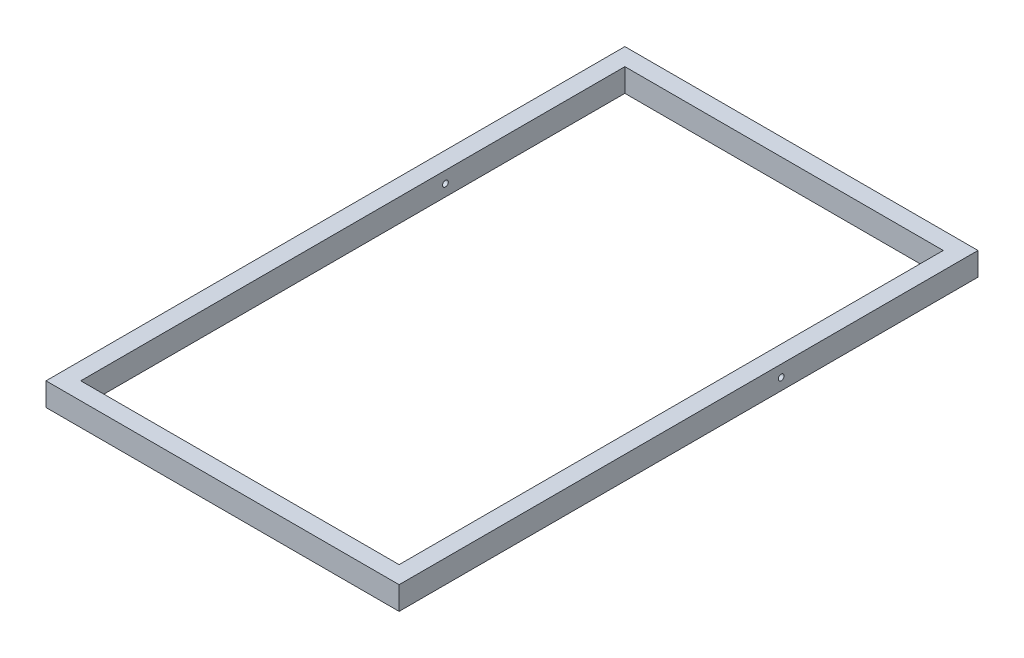
ISO-10303-21;
HEADER;
FILE_DESCRIPTION(('STEP AP214'),'2;1');
FILE_NAME('part.step','',(''),(''),'','','');
FILE_SCHEMA(('AUTOMOTIVE_DESIGN { 1 0 10303 214 1 1 1 1 }'));
ENDSEC;
DATA;
#1=APPLICATION_CONTEXT('core data for automotive mechanical design processes');
#2=APPLICATION_PROTOCOL_DEFINITION('international standard','automotive_design',2000,#1);
#3=PRODUCT_CONTEXT('',#1,'mechanical');
#4=PRODUCT('Part','Part','',(#3));
#5=PRODUCT_RELATED_PRODUCT_CATEGORY('part','',(#4));
#6=PRODUCT_DEFINITION_FORMATION('','',#4);
#7=PRODUCT_DEFINITION_CONTEXT('part definition',#1,'design');
#8=PRODUCT_DEFINITION('design','',#6,#7);
#9=PRODUCT_DEFINITION_SHAPE('','',#8);
#10=(LENGTH_UNIT() NAMED_UNIT(*) SI_UNIT(.MILLI.,.METRE.));
#11=(NAMED_UNIT(*) PLANE_ANGLE_UNIT() SI_UNIT($,.RADIAN.));
#12=(NAMED_UNIT(*) SI_UNIT($,.STERADIAN.) SOLID_ANGLE_UNIT());
#13=UNCERTAINTY_MEASURE_WITH_UNIT(LENGTH_MEASURE(1.E-05),#10,'distance_accuracy_value','');
#14=(GEOMETRIC_REPRESENTATION_CONTEXT(3) GLOBAL_UNCERTAINTY_ASSIGNED_CONTEXT((#13)) GLOBAL_UNIT_ASSIGNED_CONTEXT((#10,
#11,#12)) REPRESENTATION_CONTEXT('',''));
#15=CARTESIAN_POINT('',(0.,0.,0.));
#16=DIRECTION('',(0.,0.,1.));
#17=DIRECTION('',(1.,0.,0.));
#18=AXIS2_PLACEMENT_3D('',#15,#16,#17);
#19=CARTESIAN_POINT('',(0.,40.,0.));
#20=DIRECTION('',(0.,1.,0.));
#21=DIRECTION('',(0.,0.,1.));
#22=AXIS2_PLACEMENT_3D('',#19,#20,#21);
#23=PLANE('',#22);
#24=DIRECTION('',(-1.,0.,0.));
#25=VECTOR('',#24,1.);
#26=CARTESIAN_POINT('',(542.03426406642,40.,-973.725626832782));
#27=LINE('',#26,#25);
#28=CARTESIAN_POINT('',(542.03426406642,40.,-973.725626832782));
#29=VERTEX_POINT('',#28);
#30=CARTESIAN_POINT('',(-67.9657359335805,40.,-973.725626832782));
#31=VERTEX_POINT('',#30);
#32=EDGE_CURVE('E137',#29,#31,#27,.T.);
#33=ORIENTED_EDGE('',*,*,#32,.T.);
#34=DIRECTION('',(0.,0.,1.));
#35=VECTOR('',#34,1.);
#36=CARTESIAN_POINT('',(-67.9657359335805,40.,-973.725626832782));
#37=LINE('',#36,#35);
#38=CARTESIAN_POINT('',(-67.9657359335804,40.,26.2743731672174));
#39=VERTEX_POINT('',#38);
#40=EDGE_CURVE('E140',#31,#39,#37,.T.);
#41=ORIENTED_EDGE('',*,*,#40,.T.);
#42=DIRECTION('',(1.,0.,0.));
#43=VECTOR('',#42,1.);
#44=CARTESIAN_POINT('',(-67.9657359335804,40.,26.2743731672174));
#45=LINE('',#44,#43);
#46=CARTESIAN_POINT('',(542.03426406642,40.,26.2743731672174));
#47=VERTEX_POINT('',#46);
#48=EDGE_CURVE('E143',#39,#47,#45,.T.);
#49=ORIENTED_EDGE('',*,*,#48,.T.);
#50=DIRECTION('',(0.,0.,-1.));
#51=VECTOR('',#50,1.);
#52=CARTESIAN_POINT('',(542.03426406642,40.,26.2743731672174));
#53=LINE('',#52,#51);
#54=EDGE_CURVE('E145',#47,#29,#53,.T.);
#55=ORIENTED_EDGE('',*,*,#54,.T.);
#56=EDGE_LOOP('',(#33,#41,#49,#55));
#57=FACE_BOUND('',#56,.T.);
#58=DIRECTION('',(0.,0.,1.));
#59=VECTOR('',#58,1.);
#60=CARTESIAN_POINT('',(-37.9657359335805,40.,-943.725626832782));
#61=LINE('',#60,#59);
#62=CARTESIAN_POINT('',(-37.9657359335805,40.,-943.725626832782));
#63=VERTEX_POINT('',#62);
#64=CARTESIAN_POINT('',(-37.9657359335804,40.,-3.72562683278258));
#65=VERTEX_POINT('',#64);
#66=EDGE_CURVE('E107',#63,#65,#61,.T.);
#67=ORIENTED_EDGE('',*,*,#66,.F.);
#68=DIRECTION('',(-1.,0.,0.));
#69=VECTOR('',#68,1.);
#70=CARTESIAN_POINT('',(512.03426406642,40.,-943.725626832782));
#71=LINE('',#70,#69);
#72=CARTESIAN_POINT('',(512.03426406642,40.,-943.725626832782));
#73=VERTEX_POINT('',#72);
#74=EDGE_CURVE('E99',#73,#63,#71,.T.);
#75=ORIENTED_EDGE('',*,*,#74,.F.);
#76=DIRECTION('',(0.,0.,-1.));
#77=VECTOR('',#76,1.);
#78=CARTESIAN_POINT('',(512.03426406642,40.,-3.72562683278258));
#79=LINE('',#78,#77);
#80=CARTESIAN_POINT('',(512.03426406642,40.,-3.72562683278258));
#81=VERTEX_POINT('',#80);
#82=EDGE_CURVE('E121',#81,#73,#79,.T.);
#83=ORIENTED_EDGE('',*,*,#82,.F.);
#84=DIRECTION('',(1.,0.,0.));
#85=VECTOR('',#84,1.);
#86=CARTESIAN_POINT('',(-37.9657359335804,40.,-3.72562683278258));
#87=LINE('',#86,#85);
#88=EDGE_CURVE('E119',#65,#81,#87,.T.);
#89=ORIENTED_EDGE('',*,*,#88,.F.);
#90=EDGE_LOOP('',(#67,#75,#83,#89));
#91=FACE_BOUND('',#90,.T.);
#92=ADVANCED_FACE('F33',(#57,#91),#23,.T.);
#93=CARTESIAN_POINT('',(0.,0.,0.));
#94=DIRECTION('',(0.,1.,0.));
#95=DIRECTION('',(0.,0.,1.));
#96=AXIS2_PLACEMENT_3D('',#93,#94,#95);
#97=PLANE('',#96);
#98=DIRECTION('',(-1.,0.,0.));
#99=VECTOR('',#98,1.);
#100=CARTESIAN_POINT('',(542.03426406642,0.,-973.725626832782));
#101=LINE('',#100,#99);
#102=CARTESIAN_POINT('',(542.03426406642,0.,-973.725626832782));
#103=VERTEX_POINT('',#102);
#104=CARTESIAN_POINT('',(-67.9657359335805,0.,-973.725626832782));
#105=VERTEX_POINT('',#104);
#106=EDGE_CURVE('E115',#103,#105,#101,.T.);
#107=ORIENTED_EDGE('',*,*,#106,.F.);
#108=DIRECTION('',(0.,0.,-1.));
#109=VECTOR('',#108,1.);
#110=CARTESIAN_POINT('',(542.03426406642,0.,26.2743731672174));
#111=LINE('',#110,#109);
#112=CARTESIAN_POINT('',(542.03426406642,0.,26.2743731672174));
#113=VERTEX_POINT('',#112);
#114=EDGE_CURVE('E141',#113,#103,#111,.T.);
#115=ORIENTED_EDGE('',*,*,#114,.F.);
#116=DIRECTION('',(1.,0.,0.));
#117=VECTOR('',#116,1.);
#118=CARTESIAN_POINT('',(-67.9657359335804,0.,26.2743731672174));
#119=LINE('',#118,#117);
#120=CARTESIAN_POINT('',(-67.9657359335804,0.,26.2743731672174));
#121=VERTEX_POINT('',#120);
#122=EDGE_CURVE('E152',#121,#113,#119,.T.);
#123=ORIENTED_EDGE('',*,*,#122,.F.);
#124=DIRECTION('',(0.,0.,1.));
#125=VECTOR('',#124,1.);
#126=CARTESIAN_POINT('',(-67.9657359335805,0.,-973.725626832782));
#127=LINE('',#126,#125);
#128=EDGE_CURVE('E150',#105,#121,#127,.T.);
#129=ORIENTED_EDGE('',*,*,#128,.F.);
#130=EDGE_LOOP('',(#107,#115,#123,#129));
#131=FACE_BOUND('',#130,.T.);
#132=DIRECTION('',(-1.,0.,0.));
#133=VECTOR('',#132,1.);
#134=CARTESIAN_POINT('',(512.03426406642,0.,-943.725626832782));
#135=LINE('',#134,#133);
#136=CARTESIAN_POINT('',(512.03426406642,0.,-943.725626832782));
#137=VERTEX_POINT('',#136);
#138=CARTESIAN_POINT('',(-37.9657359335805,0.,-943.725626832782));
#139=VERTEX_POINT('',#138);
#140=EDGE_CURVE('E57',#137,#139,#135,.T.);
#141=ORIENTED_EDGE('',*,*,#140,.T.);
#142=DIRECTION('',(0.,0.,1.));
#143=VECTOR('',#142,1.);
#144=CARTESIAN_POINT('',(-37.9657359335805,0.,-943.725626832782));
#145=LINE('',#144,#143);
#146=CARTESIAN_POINT('',(-37.9657359335804,0.,-3.72562683278258));
#147=VERTEX_POINT('',#146);
#148=EDGE_CURVE('E114',#139,#147,#145,.T.);
#149=ORIENTED_EDGE('',*,*,#148,.T.);
#150=DIRECTION('',(1.,0.,0.));
#151=VECTOR('',#150,1.);
#152=CARTESIAN_POINT('',(-37.9657359335804,0.,-3.72562683278258));
#153=LINE('',#152,#151);
#154=CARTESIAN_POINT('',(512.03426406642,0.,-3.72562683278258));
#155=VERTEX_POINT('',#154);
#156=EDGE_CURVE('E129',#147,#155,#153,.T.);
#157=ORIENTED_EDGE('',*,*,#156,.T.);
#158=DIRECTION('',(0.,0.,-1.));
#159=VECTOR('',#158,1.);
#160=CARTESIAN_POINT('',(512.03426406642,0.,-3.72562683278258));
#161=LINE('',#160,#159);
#162=EDGE_CURVE('E108',#155,#137,#161,.T.);
#163=ORIENTED_EDGE('',*,*,#162,.T.);
#164=EDGE_LOOP('',(#141,#149,#157,#163));
#165=FACE_BOUND('',#164,.T.);
#166=ADVANCED_FACE('F171',(#131,#165),#97,.F.);
#167=CARTESIAN_POINT('',(542.03426406642,40.,-973.725626832782));
#168=DIRECTION('',(0.,0.,1.));
#169=DIRECTION('',(1.,0.,0.));
#170=AXIS2_PLACEMENT_3D('',#167,#168,#169);
#171=PLANE('',#170);
#172=ORIENTED_EDGE('',*,*,#106,.T.);
#173=DIRECTION('',(0.,-1.,0.));
#174=VECTOR('',#173,1.);
#175=CARTESIAN_POINT('',(-67.9657359335805,40.,-973.725626832782));
#176=LINE('',#175,#174);
#177=EDGE_CURVE('E11',#31,#105,#176,.T.);
#178=ORIENTED_EDGE('',*,*,#177,.F.);
#179=ORIENTED_EDGE('',*,*,#32,.F.);
#180=DIRECTION('',(0.,-1.,0.));
#181=VECTOR('',#180,1.);
#182=CARTESIAN_POINT('',(542.03426406642,40.,-973.725626832782));
#183=LINE('',#182,#181);
#184=EDGE_CURVE('E147',#29,#103,#183,.T.);
#185=ORIENTED_EDGE('',*,*,#184,.T.);
#186=EDGE_LOOP('',(#172,#178,#179,#185));
#187=FACE_BOUND('',#186,.T.);
#188=ADVANCED_FACE('F35',(#187),#171,.F.);
#189=CARTESIAN_POINT('',(-67.9657359335805,40.,-973.725626832782));
#190=DIRECTION('',(1.,0.,0.));
#191=DIRECTION('',(0.,0.,-1.));
#192=AXIS2_PLACEMENT_3D('',#189,#190,#191);
#193=PLANE('',#192);
#194=CARTESIAN_POINT('',(-67.9657359335805,20.,-633.725626832782));
#195=DIRECTION('',(1.,0.,0.));
#196=DIRECTION('',(0.,0.,-1.));
#197=AXIS2_PLACEMENT_3D('',#194,#195,#196);
#198=CIRCLE('',#197,5.00000000000004);
#199=CARTESIAN_POINT('',(-67.9657359335805,20.,-638.725626832782));
#200=VERTEX_POINT('',#199);
#201=EDGE_CURVE('E208',#200,#200,#198,.T.);
#202=ORIENTED_EDGE('',*,*,#201,.T.);
#203=EDGE_LOOP('',(#202));
#204=FACE_BOUND('',#203,.T.);
#205=ORIENTED_EDGE('',*,*,#128,.T.);
#206=DIRECTION('',(0.,-1.,0.));
#207=VECTOR('',#206,1.);
#208=CARTESIAN_POINT('',(-67.9657359335804,40.,26.2743731672174));
#209=LINE('',#208,#207);
#210=EDGE_CURVE('E42',#39,#121,#209,.T.);
#211=ORIENTED_EDGE('',*,*,#210,.F.);
#212=ORIENTED_EDGE('',*,*,#40,.F.);
#213=ORIENTED_EDGE('',*,*,#177,.T.);
#214=EDGE_LOOP('',(#205,#211,#212,#213));
#215=FACE_BOUND('',#214,.T.);
#216=ADVANCED_FACE('F181',(#204,#215),#193,.F.);
#217=CARTESIAN_POINT('',(-67.9657359335804,40.,26.2743731672174));
#218=DIRECTION('',(0.,0.,-1.));
#219=DIRECTION('',(-1.,0.,0.));
#220=AXIS2_PLACEMENT_3D('',#217,#218,#219);
#221=PLANE('',#220);
#222=ORIENTED_EDGE('',*,*,#122,.T.);
#223=DIRECTION('',(0.,-1.,0.));
#224=VECTOR('',#223,1.);
#225=CARTESIAN_POINT('',(542.03426406642,40.,26.2743731672174));
#226=LINE('',#225,#224);
#227=EDGE_CURVE('E157',#47,#113,#226,.T.);
#228=ORIENTED_EDGE('',*,*,#227,.F.);
#229=ORIENTED_EDGE('',*,*,#48,.F.);
#230=ORIENTED_EDGE('',*,*,#210,.T.);
#231=EDGE_LOOP('',(#222,#228,#229,#230));
#232=FACE_BOUND('',#231,.T.);
#233=ADVANCED_FACE('F165',(#232),#221,.F.);
#234=CARTESIAN_POINT('',(542.03426406642,40.,26.2743731672174));
#235=DIRECTION('',(-1.,0.,0.));
#236=DIRECTION('',(0.,0.,1.));
#237=AXIS2_PLACEMENT_3D('',#234,#235,#236);
#238=PLANE('',#237);
#239=CARTESIAN_POINT('',(542.03426406642,20.,-633.725626832782));
#240=DIRECTION('',(1.,0.,0.));
#241=DIRECTION('',(0.,0.,-1.));
#242=AXIS2_PLACEMENT_3D('',#239,#240,#241);
#243=CIRCLE('',#242,5.00000000000004);
#244=CARTESIAN_POINT('',(542.03426406642,20.,-638.725626832782));
#245=VERTEX_POINT('',#244);
#246=EDGE_CURVE('E206',#245,#245,#243,.T.);
#247=ORIENTED_EDGE('',*,*,#246,.F.);
#248=EDGE_LOOP('',(#247));
#249=FACE_BOUND('',#248,.T.);
#250=ORIENTED_EDGE('',*,*,#114,.T.);
#251=ORIENTED_EDGE('',*,*,#184,.F.);
#252=ORIENTED_EDGE('',*,*,#54,.F.);
#253=ORIENTED_EDGE('',*,*,#227,.T.);
#254=EDGE_LOOP('',(#250,#251,#252,#253));
#255=FACE_BOUND('',#254,.T.);
#256=ADVANCED_FACE('F175',(#249,#255),#238,.F.);
#257=CARTESIAN_POINT('',(512.03426406642,40.,-943.725626832782));
#258=DIRECTION('',(0.,0.,1.));
#259=DIRECTION('',(1.,0.,0.));
#260=AXIS2_PLACEMENT_3D('',#257,#258,#259);
#261=PLANE('',#260);
#262=ORIENTED_EDGE('',*,*,#140,.F.);
#263=DIRECTION('',(0.,-1.,0.));
#264=VECTOR('',#263,1.);
#265=CARTESIAN_POINT('',(512.03426406642,40.,-943.725626832782));
#266=LINE('',#265,#264);
#267=EDGE_CURVE('E103',#73,#137,#266,.T.);
#268=ORIENTED_EDGE('',*,*,#267,.F.);
#269=ORIENTED_EDGE('',*,*,#74,.T.);
#270=DIRECTION('',(0.,-1.,0.));
#271=VECTOR('',#270,1.);
#272=CARTESIAN_POINT('',(-37.9657359335805,40.,-943.725626832782));
#273=LINE('',#272,#271);
#274=EDGE_CURVE('E102',#63,#139,#273,.T.);
#275=ORIENTED_EDGE('',*,*,#274,.T.);
#276=EDGE_LOOP('',(#262,#268,#269,#275));
#277=FACE_BOUND('',#276,.T.);
#278=ADVANCED_FACE('F101',(#277),#261,.T.);
#279=CARTESIAN_POINT('',(-37.9657359335805,40.,-943.725626832782));
#280=DIRECTION('',(1.,0.,0.));
#281=DIRECTION('',(0.,0.,-1.));
#282=AXIS2_PLACEMENT_3D('',#279,#280,#281);
#283=PLANE('',#282);
#284=CARTESIAN_POINT('',(-37.9657359335805,20.,-633.725626832782));
#285=DIRECTION('',(1.,0.,0.));
#286=DIRECTION('',(0.,0.,-1.));
#287=AXIS2_PLACEMENT_3D('',#284,#285,#286);
#288=CIRCLE('',#287,5.00000000000004);
#289=CARTESIAN_POINT('',(-37.9657359335805,20.,-638.725626832782));
#290=VERTEX_POINT('',#289);
#291=EDGE_CURVE('E127',#290,#290,#288,.T.);
#292=ORIENTED_EDGE('',*,*,#291,.F.);
#293=EDGE_LOOP('',(#292));
#294=FACE_BOUND('',#293,.T.);
#295=ORIENTED_EDGE('',*,*,#148,.F.);
#296=ORIENTED_EDGE('',*,*,#274,.F.);
#297=ORIENTED_EDGE('',*,*,#66,.T.);
#298=DIRECTION('',(0.,-1.,0.));
#299=VECTOR('',#298,1.);
#300=CARTESIAN_POINT('',(-37.9657359335804,40.,-3.72562683278258));
#301=LINE('',#300,#299);
#302=EDGE_CURVE('E116',#65,#147,#301,.T.);
#303=ORIENTED_EDGE('',*,*,#302,.T.);
#304=EDGE_LOOP('',(#295,#296,#297,#303));
#305=FACE_BOUND('',#304,.T.);
#306=ADVANCED_FACE('F111',(#294,#305),#283,.T.);
#307=CARTESIAN_POINT('',(-37.9657359335804,40.,-3.72562683278258));
#308=DIRECTION('',(0.,0.,-1.));
#309=DIRECTION('',(-1.,0.,0.));
#310=AXIS2_PLACEMENT_3D('',#307,#308,#309);
#311=PLANE('',#310);
#312=ORIENTED_EDGE('',*,*,#156,.F.);
#313=ORIENTED_EDGE('',*,*,#302,.F.);
#314=ORIENTED_EDGE('',*,*,#88,.T.);
#315=DIRECTION('',(0.,-1.,0.));
#316=VECTOR('',#315,1.);
#317=CARTESIAN_POINT('',(512.03426406642,40.,-3.72562683278258));
#318=LINE('',#317,#316);
#319=EDGE_CURVE('E49',#81,#155,#318,.T.);
#320=ORIENTED_EDGE('',*,*,#319,.T.);
#321=EDGE_LOOP('',(#312,#313,#314,#320));
#322=FACE_BOUND('',#321,.T.);
#323=ADVANCED_FACE('F221',(#322),#311,.T.);
#324=CARTESIAN_POINT('',(512.03426406642,40.,-3.72562683278258));
#325=DIRECTION('',(-1.,0.,0.));
#326=DIRECTION('',(0.,0.,1.));
#327=AXIS2_PLACEMENT_3D('',#324,#325,#326);
#328=PLANE('',#327);
#329=CARTESIAN_POINT('',(512.03426406642,20.,-633.725626832782));
#330=DIRECTION('',(-1.,0.,0.));
#331=DIRECTION('',(0.,0.,1.));
#332=AXIS2_PLACEMENT_3D('',#329,#330,#331);
#333=CIRCLE('',#332,5.00000000000004);
#334=CARTESIAN_POINT('',(512.03426406642,20.,-628.725626832782));
#335=VERTEX_POINT('',#334);
#336=EDGE_CURVE('E37',#335,#335,#333,.T.);
#337=ORIENTED_EDGE('',*,*,#336,.F.);
#338=EDGE_LOOP('',(#337));
#339=FACE_BOUND('',#338,.T.);
#340=ORIENTED_EDGE('',*,*,#162,.F.);
#341=ORIENTED_EDGE('',*,*,#319,.F.);
#342=ORIENTED_EDGE('',*,*,#82,.T.);
#343=ORIENTED_EDGE('',*,*,#267,.T.);
#344=EDGE_LOOP('',(#340,#341,#342,#343));
#345=FACE_BOUND('',#344,.T.);
#346=ADVANCED_FACE('F219',(#339,#345),#328,.T.);
#347=CARTESIAN_POINT('',(-67.9657359335805,20.,-633.725626832782));
#348=DIRECTION('',(1.,0.,0.));
#349=DIRECTION('',(0.,0.,-1.));
#350=AXIS2_PLACEMENT_3D('',#347,#348,#349);
#351=CYLINDRICAL_SURFACE('',#350,5.00000000000004);
#352=ORIENTED_EDGE('',*,*,#336,.T.);
#353=EDGE_LOOP('',(#352));
#354=FACE_BOUND('',#353,.T.);
#355=ORIENTED_EDGE('',*,*,#246,.T.);
#356=EDGE_LOOP('',(#355));
#357=FACE_BOUND('',#356,.T.);
#358=ADVANCED_FACE('F217',(#354,#357),#351,.F.);
#359=ORIENTED_EDGE('',*,*,#291,.T.);
#360=EDGE_LOOP('',(#359));
#361=FACE_BOUND('',#360,.T.);
#362=ORIENTED_EDGE('',*,*,#201,.F.);
#363=EDGE_LOOP('',(#362));
#364=FACE_BOUND('',#363,.T.);
#365=ADVANCED_FACE('F233',(#361,#364),#351,.F.);
#366=CLOSED_SHELL('',(#92,#166,#188,#216,#233,#256,#278,#306,#323,#346,#358,#365));
#367=MANIFOLD_SOLID_BREP('B2',#366);
#368=ADVANCED_BREP_SHAPE_REPRESENTATION('',(#18,#367),#14);
#369=SHAPE_DEFINITION_REPRESENTATION(#9,#368);
ENDSEC;
END-ISO-10303-21;
